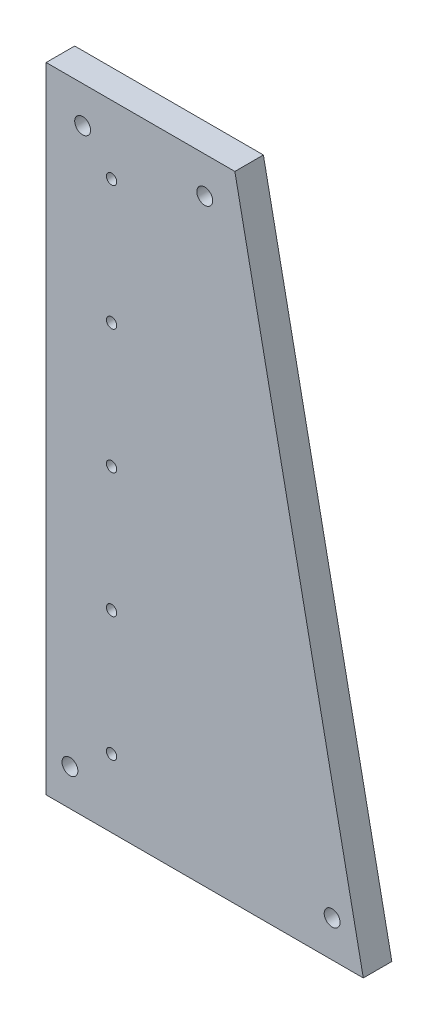
ISO-10303-21;
HEADER;
FILE_DESCRIPTION(('STEP AP214'),'2;1');
FILE_NAME('part.step','',(''),(''),'','','');
FILE_SCHEMA(('AUTOMOTIVE_DESIGN { 1 0 10303 214 1 1 1 1 }'));
ENDSEC;
DATA;
#1=APPLICATION_CONTEXT('core data for automotive mechanical design processes');
#2=APPLICATION_PROTOCOL_DEFINITION('international standard','automotive_design',2000,#1);
#3=PRODUCT_CONTEXT('',#1,'mechanical');
#4=PRODUCT('Part','Part','',(#3));
#5=PRODUCT_RELATED_PRODUCT_CATEGORY('part','',(#4));
#6=PRODUCT_DEFINITION_FORMATION('','',#4);
#7=PRODUCT_DEFINITION_CONTEXT('part definition',#1,'design');
#8=PRODUCT_DEFINITION('design','',#6,#7);
#9=PRODUCT_DEFINITION_SHAPE('','',#8);
#10=(LENGTH_UNIT() NAMED_UNIT(*) SI_UNIT(.MILLI.,.METRE.));
#11=(NAMED_UNIT(*) PLANE_ANGLE_UNIT() SI_UNIT($,.RADIAN.));
#12=(NAMED_UNIT(*) SI_UNIT($,.STERADIAN.) SOLID_ANGLE_UNIT());
#13=UNCERTAINTY_MEASURE_WITH_UNIT(LENGTH_MEASURE(1.E-05),#10,'distance_accuracy_value','');
#14=(GEOMETRIC_REPRESENTATION_CONTEXT(3) GLOBAL_UNCERTAINTY_ASSIGNED_CONTEXT((#13)) GLOBAL_UNIT_ASSIGNED_CONTEXT((#10,
#11,#12)) REPRESENTATION_CONTEXT('',''));
#15=CARTESIAN_POINT('',(0.,0.,0.));
#16=DIRECTION('',(0.,0.,1.));
#17=DIRECTION('',(1.,0.,0.));
#18=AXIS2_PLACEMENT_3D('',#15,#16,#17);
#19=CARTESIAN_POINT('',(-184.310735066979,157.079646017699,18.));
#20=DIRECTION('',(1.,0.,0.));
#21=DIRECTION('',(0.,0.,-1.));
#22=AXIS2_PLACEMENT_3D('',#19,#20,#21);
#23=PLANE('',#22);
#24=DIRECTION('',(0.,-1.,0.));
#25=VECTOR('',#24,1.);
#26=CARTESIAN_POINT('',(-184.310735066979,157.079646017699,0.));
#27=LINE('',#26,#25);
#28=CARTESIAN_POINT('',(-184.310735066979,157.079646017699,0.));
#29=VERTEX_POINT('',#28);
#30=CARTESIAN_POINT('',(-184.310735066979,-242.920353982301,0.));
#31=VERTEX_POINT('',#30);
#32=EDGE_CURVE('E97',#29,#31,#27,.T.);
#33=ORIENTED_EDGE('',*,*,#32,.T.);
#34=DIRECTION('',(0.,0.,-1.));
#35=VECTOR('',#34,1.);
#36=CARTESIAN_POINT('',(-184.310735066979,-242.920353982301,18.));
#37=LINE('',#36,#35);
#38=CARTESIAN_POINT('',(-184.310735066979,-242.920353982301,18.));
#39=VERTEX_POINT('',#38);
#40=EDGE_CURVE('E11',#39,#31,#37,.T.);
#41=ORIENTED_EDGE('',*,*,#40,.F.);
#42=DIRECTION('',(0.,-1.,0.));
#43=VECTOR('',#42,1.);
#44=CARTESIAN_POINT('',(-184.310735066979,157.079646017699,18.));
#45=LINE('',#44,#43);
#46=CARTESIAN_POINT('',(-184.310735066979,157.079646017699,18.));
#47=VERTEX_POINT('',#46);
#48=EDGE_CURVE('E85',#47,#39,#45,.T.);
#49=ORIENTED_EDGE('',*,*,#48,.F.);
#50=DIRECTION('',(0.,0.,-1.));
#51=VECTOR('',#50,1.);
#52=CARTESIAN_POINT('',(-184.310735066979,157.079646017699,18.));
#53=LINE('',#52,#51);
#54=EDGE_CURVE('E93',#47,#29,#53,.T.);
#55=ORIENTED_EDGE('',*,*,#54,.T.);
#56=EDGE_LOOP('',(#33,#41,#49,#55));
#57=FACE_BOUND('',#56,.T.);
#58=ADVANCED_FACE('F34',(#57),#23,.F.);
#59=CARTESIAN_POINT('',(15.6892649330213,-242.920353982301,18.));
#60=DIRECTION('',(0.,1.,0.));
#61=DIRECTION('',(-1.,0.,0.));
#62=AXIS2_PLACEMENT_3D('',#59,#60,#61);
#63=PLANE('',#62);
#64=DIRECTION('',(1.,0.,0.));
#65=VECTOR('',#64,1.);
#66=CARTESIAN_POINT('',(15.6892649330213,-242.920353982301,0.));
#67=LINE('',#66,#65);
#68=CARTESIAN_POINT('',(15.6892649330213,-242.920353982301,0.));
#69=VERTEX_POINT('',#68);
#70=EDGE_CURVE('E89',#31,#69,#67,.T.);
#71=ORIENTED_EDGE('',*,*,#70,.T.);
#72=DIRECTION('',(0.,0.,-1.));
#73=VECTOR('',#72,1.);
#74=CARTESIAN_POINT('',(15.6892649330213,-242.920353982301,18.));
#75=LINE('',#74,#73);
#76=CARTESIAN_POINT('',(15.6892649330213,-242.920353982301,18.));
#77=VERTEX_POINT('',#76);
#78=EDGE_CURVE('E42',#77,#69,#75,.T.);
#79=ORIENTED_EDGE('',*,*,#78,.F.);
#80=DIRECTION('',(1.,0.,0.));
#81=VECTOR('',#80,1.);
#82=CARTESIAN_POINT('',(-184.310735066979,-242.920353982301,18.));
#83=LINE('',#82,#81);
#84=EDGE_CURVE('E80',#39,#77,#83,.T.);
#85=ORIENTED_EDGE('',*,*,#84,.F.);
#86=ORIENTED_EDGE('',*,*,#40,.T.);
#87=EDGE_LOOP('',(#71,#79,#85,#86));
#88=FACE_BOUND('',#87,.T.);
#89=ADVANCED_FACE('F88',(#88),#63,.F.);
#90=CARTESIAN_POINT('',(-65.3107350669788,157.079646017699,18.));
#91=DIRECTION('',(-0.980106640178793,-0.198471594636206,0.));
#92=DIRECTION('',(0.198471594636206,-0.980106640178793,0.));
#93=AXIS2_PLACEMENT_3D('',#90,#91,#92);
#94=PLANE('',#93);
#95=DIRECTION('',(-0.198471594636206,0.980106640178793,0.));
#96=VECTOR('',#95,1.);
#97=CARTESIAN_POINT('',(-65.3107350669788,157.079646017699,0.));
#98=LINE('',#97,#96);
#99=CARTESIAN_POINT('',(-65.3107350669788,157.079646017699,0.));
#100=VERTEX_POINT('',#99);
#101=EDGE_CURVE('E67',#69,#100,#98,.T.);
#102=ORIENTED_EDGE('',*,*,#101,.T.);
#103=DIRECTION('',(0.,0.,-1.));
#104=VECTOR('',#103,1.);
#105=CARTESIAN_POINT('',(-65.3107350669788,157.079646017699,18.));
#106=LINE('',#105,#104);
#107=CARTESIAN_POINT('',(-65.3107350669788,157.079646017699,18.));
#108=VERTEX_POINT('',#107);
#109=EDGE_CURVE('E90',#108,#100,#106,.T.);
#110=ORIENTED_EDGE('',*,*,#109,.F.);
#111=DIRECTION('',(-0.198471594636206,0.980106640178793,0.));
#112=VECTOR('',#111,1.);
#113=CARTESIAN_POINT('',(-65.3107350669788,157.079646017699,18.));
#114=LINE('',#113,#112);
#115=EDGE_CURVE('E83',#77,#108,#114,.T.);
#116=ORIENTED_EDGE('',*,*,#115,.F.);
#117=ORIENTED_EDGE('',*,*,#78,.T.);
#118=EDGE_LOOP('',(#102,#110,#116,#117));
#119=FACE_BOUND('',#118,.T.);
#120=ADVANCED_FACE('F91',(#119),#94,.F.);
#121=CARTESIAN_POINT('',(-184.310735066979,157.079646017699,18.));
#122=DIRECTION('',(0.,-1.,0.));
#123=DIRECTION('',(0.,0.,-1.));
#124=AXIS2_PLACEMENT_3D('',#121,#122,#123);
#125=PLANE('',#124);
#126=DIRECTION('',(-1.,0.,0.));
#127=VECTOR('',#126,1.);
#128=CARTESIAN_POINT('',(-184.310735066979,157.079646017699,0.));
#129=LINE('',#128,#127);
#130=EDGE_CURVE('E73',#100,#29,#129,.T.);
#131=ORIENTED_EDGE('',*,*,#130,.T.);
#132=ORIENTED_EDGE('',*,*,#54,.F.);
#133=DIRECTION('',(-1.,0.,0.));
#134=VECTOR('',#133,1.);
#135=CARTESIAN_POINT('',(-184.310735066979,157.079646017699,18.));
#136=LINE('',#135,#134);
#137=EDGE_CURVE('E50',#108,#47,#136,.T.);
#138=ORIENTED_EDGE('',*,*,#137,.F.);
#139=ORIENTED_EDGE('',*,*,#109,.T.);
#140=EDGE_LOOP('',(#131,#132,#138,#139));
#141=FACE_BOUND('',#140,.T.);
#142=ADVANCED_FACE('F105',(#141),#125,.F.);
#143=CARTESIAN_POINT('',(0.,0.,18.));
#144=DIRECTION('',(0.,0.,1.));
#145=DIRECTION('',(1.,0.,0.));
#146=AXIS2_PLACEMENT_3D('',#143,#144,#145);
#147=PLANE('',#146);
#148=CARTESIAN_POINT('',(-161.310735066979,134.079646017699,18.));
#149=DIRECTION('',(0.,0.,-1.));
#150=DIRECTION('',(-1.,0.,0.));
#151=AXIS2_PLACEMENT_3D('',#148,#149,#150);
#152=CIRCLE('',#151,5.00000000000002);
#153=CARTESIAN_POINT('',(-166.310735066979,134.079646017699,18.));
#154=VERTEX_POINT('',#153);
#155=EDGE_CURVE('E114',#154,#154,#152,.T.);
#156=ORIENTED_EDGE('',*,*,#155,.T.);
#157=EDGE_LOOP('',(#156));
#158=FACE_BOUND('',#157,.T.);
#159=CARTESIAN_POINT('',(-143.060735066979,114.079646017699,18.));
#160=DIRECTION('',(0.,0.,-1.));
#161=DIRECTION('',(-1.,0.,0.));
#162=AXIS2_PLACEMENT_3D('',#159,#160,#161);
#163=CIRCLE('',#162,3.25000000000003);
#164=CARTESIAN_POINT('',(-146.310735066979,114.079646017699,18.));
#165=VERTEX_POINT('',#164);
#166=EDGE_CURVE('E156',#165,#165,#163,.T.);
#167=ORIENTED_EDGE('',*,*,#166,.T.);
#168=EDGE_LOOP('',(#167));
#169=FACE_BOUND('',#168,.T.);
#170=CARTESIAN_POINT('',(-143.06073506698,35.5796460176992,18.));
#171=DIRECTION('',(0.,0.,-1.));
#172=DIRECTION('',(-1.,0.,0.));
#173=AXIS2_PLACEMENT_3D('',#170,#171,#172);
#174=CIRCLE('',#173,3.25000000000003);
#175=CARTESIAN_POINT('',(-146.31073506698,35.5796460176992,18.));
#176=VERTEX_POINT('',#175);
#177=EDGE_CURVE('E150',#176,#176,#174,.T.);
#178=ORIENTED_EDGE('',*,*,#177,.T.);
#179=EDGE_LOOP('',(#178));
#180=FACE_BOUND('',#179,.T.);
#181=CARTESIAN_POINT('',(-143.06073506698,-42.9203539823008,18.));
#182=DIRECTION('',(0.,0.,-1.));
#183=DIRECTION('',(-1.,0.,0.));
#184=AXIS2_PLACEMENT_3D('',#181,#182,#183);
#185=CIRCLE('',#184,3.25000000000003);
#186=CARTESIAN_POINT('',(-146.31073506698,-42.9203539823008,18.));
#187=VERTEX_POINT('',#186);
#188=EDGE_CURVE('E144',#187,#187,#185,.T.);
#189=ORIENTED_EDGE('',*,*,#188,.T.);
#190=EDGE_LOOP('',(#189));
#191=FACE_BOUND('',#190,.T.);
#192=CARTESIAN_POINT('',(-143.060735066982,-199.920353982301,18.));
#193=DIRECTION('',(0.,0.,-1.));
#194=DIRECTION('',(-1.,0.,0.));
#195=AXIS2_PLACEMENT_3D('',#192,#193,#194);
#196=CIRCLE('',#195,3.25000000000003);
#197=CARTESIAN_POINT('',(-146.310735066982,-199.920353982301,18.));
#198=VERTEX_POINT('',#197);
#199=EDGE_CURVE('E134',#198,#198,#196,.T.);
#200=ORIENTED_EDGE('',*,*,#199,.T.);
#201=EDGE_LOOP('',(#200));
#202=FACE_BOUND('',#201,.T.);
#203=CARTESIAN_POINT('',(-3.96823506697869,-219.920353982301,18.));
#204=DIRECTION('',(0.,0.,-1.));
#205=DIRECTION('',(-1.,0.,0.));
#206=AXIS2_PLACEMENT_3D('',#203,#204,#205);
#207=CIRCLE('',#206,5.);
#208=CARTESIAN_POINT('',(-8.96823506697869,-219.920353982301,18.));
#209=VERTEX_POINT('',#208);
#210=EDGE_CURVE('E121',#209,#209,#207,.T.);
#211=ORIENTED_EDGE('',*,*,#210,.T.);
#212=EDGE_LOOP('',(#211));
#213=FACE_BOUND('',#212,.T.);
#214=CARTESIAN_POINT('',(-169.310735066979,-219.920353982301,18.));
#215=DIRECTION('',(0.,0.,-1.));
#216=DIRECTION('',(-1.,0.,0.));
#217=AXIS2_PLACEMENT_3D('',#214,#215,#216);
#218=CIRCLE('',#217,4.99999999999999);
#219=CARTESIAN_POINT('',(-174.310735066979,-219.920353982301,18.));
#220=VERTEX_POINT('',#219);
#221=EDGE_CURVE('E120',#220,#220,#218,.T.);
#222=ORIENTED_EDGE('',*,*,#221,.T.);
#223=EDGE_LOOP('',(#222));
#224=FACE_BOUND('',#223,.T.);
#225=CARTESIAN_POINT('',(-143.060735066981,-121.420353982301,18.));
#226=DIRECTION('',(0.,0.,-1.));
#227=DIRECTION('',(-1.,0.,0.));
#228=AXIS2_PLACEMENT_3D('',#225,#226,#227);
#229=CIRCLE('',#228,3.25000000000003);
#230=CARTESIAN_POINT('',(-146.310735066981,-121.420353982301,18.));
#231=VERTEX_POINT('',#230);
#232=EDGE_CURVE('E127',#231,#231,#229,.T.);
#233=ORIENTED_EDGE('',*,*,#232,.T.);
#234=EDGE_LOOP('',(#233));
#235=FACE_BOUND('',#234,.T.);
#236=CARTESIAN_POINT('',(-84.3107350669788,134.079646017699,18.));
#237=DIRECTION('',(0.,0.,-1.));
#238=DIRECTION('',(-1.,0.,0.));
#239=AXIS2_PLACEMENT_3D('',#236,#237,#238);
#240=CIRCLE('',#239,5.00000000000001);
#241=CARTESIAN_POINT('',(-89.3107350669788,134.079646017699,18.));
#242=VERTEX_POINT('',#241);
#243=EDGE_CURVE('E100',#242,#242,#240,.T.);
#244=ORIENTED_EDGE('',*,*,#243,.T.);
#245=EDGE_LOOP('',(#244));
#246=FACE_BOUND('',#245,.T.);
#247=ORIENTED_EDGE('',*,*,#48,.T.);
#248=ORIENTED_EDGE('',*,*,#84,.T.);
#249=ORIENTED_EDGE('',*,*,#115,.T.);
#250=ORIENTED_EDGE('',*,*,#137,.T.);
#251=EDGE_LOOP('',(#247,#248,#249,#250));
#252=FACE_BOUND('',#251,.T.);
#253=ADVANCED_FACE('F81',(#158,#169,#180,#191,#202,#213,#224,#235,#246,#252),#147,.T.);
#254=CARTESIAN_POINT('',(0.,0.,0.));
#255=DIRECTION('',(0.,0.,1.));
#256=DIRECTION('',(1.,0.,0.));
#257=AXIS2_PLACEMENT_3D('',#254,#255,#256);
#258=PLANE('',#257);
#259=CARTESIAN_POINT('',(-161.310735066979,134.079646017699,0.));
#260=DIRECTION('',(0.,0.,-1.));
#261=DIRECTION('',(-1.,0.,0.));
#262=AXIS2_PLACEMENT_3D('',#259,#260,#261);
#263=CIRCLE('',#262,5.00000000000002);
#264=CARTESIAN_POINT('',(-166.310735066979,134.079646017699,0.));
#265=VERTEX_POINT('',#264);
#266=EDGE_CURVE('E159',#265,#265,#263,.T.);
#267=ORIENTED_EDGE('',*,*,#266,.F.);
#268=EDGE_LOOP('',(#267));
#269=FACE_BOUND('',#268,.T.);
#270=CARTESIAN_POINT('',(-143.060735066979,114.079646017699,0.));
#271=DIRECTION('',(0.,0.,-1.));
#272=DIRECTION('',(-1.,0.,0.));
#273=AXIS2_PLACEMENT_3D('',#270,#271,#272);
#274=CIRCLE('',#273,3.25000000000003);
#275=CARTESIAN_POINT('',(-146.310735066979,114.079646017699,0.));
#276=VERTEX_POINT('',#275);
#277=EDGE_CURVE('E153',#276,#276,#274,.T.);
#278=ORIENTED_EDGE('',*,*,#277,.F.);
#279=EDGE_LOOP('',(#278));
#280=FACE_BOUND('',#279,.T.);
#281=CARTESIAN_POINT('',(-143.06073506698,35.5796460176992,0.));
#282=DIRECTION('',(0.,0.,-1.));
#283=DIRECTION('',(-1.,0.,0.));
#284=AXIS2_PLACEMENT_3D('',#281,#282,#283);
#285=CIRCLE('',#284,3.25000000000003);
#286=CARTESIAN_POINT('',(-146.31073506698,35.5796460176992,0.));
#287=VERTEX_POINT('',#286);
#288=EDGE_CURVE('E147',#287,#287,#285,.T.);
#289=ORIENTED_EDGE('',*,*,#288,.F.);
#290=EDGE_LOOP('',(#289));
#291=FACE_BOUND('',#290,.T.);
#292=CARTESIAN_POINT('',(-143.06073506698,-42.9203539823008,0.));
#293=DIRECTION('',(0.,0.,-1.));
#294=DIRECTION('',(-1.,0.,0.));
#295=AXIS2_PLACEMENT_3D('',#292,#293,#294);
#296=CIRCLE('',#295,3.25000000000003);
#297=CARTESIAN_POINT('',(-146.31073506698,-42.9203539823008,0.));
#298=VERTEX_POINT('',#297);
#299=EDGE_CURVE('E130',#298,#298,#296,.T.);
#300=ORIENTED_EDGE('',*,*,#299,.F.);
#301=EDGE_LOOP('',(#300));
#302=FACE_BOUND('',#301,.T.);
#303=CARTESIAN_POINT('',(-143.060735066982,-199.920353982301,0.));
#304=DIRECTION('',(0.,0.,-1.));
#305=DIRECTION('',(-1.,0.,0.));
#306=AXIS2_PLACEMENT_3D('',#303,#304,#305);
#307=CIRCLE('',#306,3.25000000000003);
#308=CARTESIAN_POINT('',(-146.310735066982,-199.920353982301,0.));
#309=VERTEX_POINT('',#308);
#310=EDGE_CURVE('E131',#309,#309,#307,.T.);
#311=ORIENTED_EDGE('',*,*,#310,.F.);
#312=EDGE_LOOP('',(#311));
#313=FACE_BOUND('',#312,.T.);
#314=CARTESIAN_POINT('',(-3.96823506697869,-219.920353982301,0.));
#315=DIRECTION('',(0.,0.,-1.));
#316=DIRECTION('',(-1.,0.,0.));
#317=AXIS2_PLACEMENT_3D('',#314,#315,#316);
#318=CIRCLE('',#317,5.);
#319=CARTESIAN_POINT('',(-8.96823506697869,-219.920353982301,0.));
#320=VERTEX_POINT('',#319);
#321=EDGE_CURVE('E137',#320,#320,#318,.T.);
#322=ORIENTED_EDGE('',*,*,#321,.F.);
#323=EDGE_LOOP('',(#322));
#324=FACE_BOUND('',#323,.T.);
#325=CARTESIAN_POINT('',(-169.310735066979,-219.920353982301,0.));
#326=DIRECTION('',(0.,0.,-1.));
#327=DIRECTION('',(-1.,0.,0.));
#328=AXIS2_PLACEMENT_3D('',#325,#326,#327);
#329=CIRCLE('',#328,4.99999999999999);
#330=CARTESIAN_POINT('',(-174.310735066979,-219.920353982301,0.));
#331=VERTEX_POINT('',#330);
#332=EDGE_CURVE('E117',#331,#331,#329,.T.);
#333=ORIENTED_EDGE('',*,*,#332,.F.);
#334=EDGE_LOOP('',(#333));
#335=FACE_BOUND('',#334,.T.);
#336=CARTESIAN_POINT('',(-143.060735066981,-121.420353982301,0.));
#337=DIRECTION('',(0.,0.,-1.));
#338=DIRECTION('',(-1.,0.,0.));
#339=AXIS2_PLACEMENT_3D('',#336,#337,#338);
#340=CIRCLE('',#339,3.25000000000003);
#341=CARTESIAN_POINT('',(-146.310735066981,-121.420353982301,0.));
#342=VERTEX_POINT('',#341);
#343=EDGE_CURVE('E124',#342,#342,#340,.T.);
#344=ORIENTED_EDGE('',*,*,#343,.F.);
#345=EDGE_LOOP('',(#344));
#346=FACE_BOUND('',#345,.T.);
#347=CARTESIAN_POINT('',(-84.3107350669788,134.079646017699,0.));
#348=DIRECTION('',(0.,0.,-1.));
#349=DIRECTION('',(-1.,0.,0.));
#350=AXIS2_PLACEMENT_3D('',#347,#348,#349);
#351=CIRCLE('',#350,5.00000000000001);
#352=CARTESIAN_POINT('',(-89.3107350669788,134.079646017699,0.));
#353=VERTEX_POINT('',#352);
#354=EDGE_CURVE('E111',#353,#353,#351,.T.);
#355=ORIENTED_EDGE('',*,*,#354,.F.);
#356=EDGE_LOOP('',(#355));
#357=FACE_BOUND('',#356,.T.);
#358=ORIENTED_EDGE('',*,*,#32,.F.);
#359=ORIENTED_EDGE('',*,*,#130,.F.);
#360=ORIENTED_EDGE('',*,*,#101,.F.);
#361=ORIENTED_EDGE('',*,*,#70,.F.);
#362=EDGE_LOOP('',(#358,#359,#360,#361));
#363=FACE_BOUND('',#362,.T.);
#364=ADVANCED_FACE('F108',(#269,#280,#291,#302,#313,#324,#335,#346,#357,#363),#258,.F.);
#365=CARTESIAN_POINT('',(-84.3107350669788,134.079646017699,18.));
#366=DIRECTION('',(0.,0.,-1.));
#367=DIRECTION('',(-1.,0.,0.));
#368=AXIS2_PLACEMENT_3D('',#365,#366,#367);
#369=CYLINDRICAL_SURFACE('',#368,5.00000000000001);
#370=ORIENTED_EDGE('',*,*,#243,.F.);
#371=EDGE_LOOP('',(#370));
#372=FACE_BOUND('',#371,.T.);
#373=ORIENTED_EDGE('',*,*,#354,.T.);
#374=EDGE_LOOP('',(#373));
#375=FACE_BOUND('',#374,.T.);
#376=ADVANCED_FACE('F176',(#372,#375),#369,.F.);
#377=CARTESIAN_POINT('',(-143.060735066981,-121.420353982301,18.));
#378=DIRECTION('',(0.,0.,-1.));
#379=DIRECTION('',(-1.,0.,0.));
#380=AXIS2_PLACEMENT_3D('',#377,#378,#379);
#381=CYLINDRICAL_SURFACE('',#380,3.25000000000003);
#382=ORIENTED_EDGE('',*,*,#232,.F.);
#383=EDGE_LOOP('',(#382));
#384=FACE_BOUND('',#383,.T.);
#385=ORIENTED_EDGE('',*,*,#343,.T.);
#386=EDGE_LOOP('',(#385));
#387=FACE_BOUND('',#386,.T.);
#388=ADVANCED_FACE('F195',(#384,#387),#381,.F.);
#389=CARTESIAN_POINT('',(-169.310735066979,-219.920353982301,18.));
#390=DIRECTION('',(0.,0.,-1.));
#391=DIRECTION('',(-1.,0.,0.));
#392=AXIS2_PLACEMENT_3D('',#389,#390,#391);
#393=CYLINDRICAL_SURFACE('',#392,4.99999999999999);
#394=ORIENTED_EDGE('',*,*,#221,.F.);
#395=EDGE_LOOP('',(#394));
#396=FACE_BOUND('',#395,.T.);
#397=ORIENTED_EDGE('',*,*,#332,.T.);
#398=EDGE_LOOP('',(#397));
#399=FACE_BOUND('',#398,.T.);
#400=ADVANCED_FACE('F201',(#396,#399),#393,.F.);
#401=CARTESIAN_POINT('',(-3.96823506697869,-219.920353982301,18.));
#402=DIRECTION('',(0.,0.,-1.));
#403=DIRECTION('',(-1.,0.,0.));
#404=AXIS2_PLACEMENT_3D('',#401,#402,#403);
#405=CYLINDRICAL_SURFACE('',#404,5.);
#406=ORIENTED_EDGE('',*,*,#210,.F.);
#407=EDGE_LOOP('',(#406));
#408=FACE_BOUND('',#407,.T.);
#409=ORIENTED_EDGE('',*,*,#321,.T.);
#410=EDGE_LOOP('',(#409));
#411=FACE_BOUND('',#410,.T.);
#412=ADVANCED_FACE('F245',(#408,#411),#405,.F.);
#413=CARTESIAN_POINT('',(-143.060735066982,-199.920353982301,18.));
#414=DIRECTION('',(0.,0.,-1.));
#415=DIRECTION('',(-1.,0.,0.));
#416=AXIS2_PLACEMENT_3D('',#413,#414,#415);
#417=CYLINDRICAL_SURFACE('',#416,3.25000000000003);
#418=ORIENTED_EDGE('',*,*,#199,.F.);
#419=EDGE_LOOP('',(#418));
#420=FACE_BOUND('',#419,.T.);
#421=ORIENTED_EDGE('',*,*,#310,.T.);
#422=EDGE_LOOP('',(#421));
#423=FACE_BOUND('',#422,.T.);
#424=ADVANCED_FACE('F254',(#420,#423),#417,.F.);
#425=CARTESIAN_POINT('',(-143.06073506698,-42.9203539823008,18.));
#426=DIRECTION('',(0.,0.,-1.));
#427=DIRECTION('',(-1.,0.,0.));
#428=AXIS2_PLACEMENT_3D('',#425,#426,#427);
#429=CYLINDRICAL_SURFACE('',#428,3.25000000000003);
#430=ORIENTED_EDGE('',*,*,#188,.F.);
#431=EDGE_LOOP('',(#430));
#432=FACE_BOUND('',#431,.T.);
#433=ORIENTED_EDGE('',*,*,#299,.T.);
#434=EDGE_LOOP('',(#433));
#435=FACE_BOUND('',#434,.T.);
#436=ADVANCED_FACE('F264',(#432,#435),#429,.F.);
#437=CARTESIAN_POINT('',(-143.06073506698,35.5796460176992,18.));
#438=DIRECTION('',(0.,0.,-1.));
#439=DIRECTION('',(-1.,0.,0.));
#440=AXIS2_PLACEMENT_3D('',#437,#438,#439);
#441=CYLINDRICAL_SURFACE('',#440,3.25000000000003);
#442=ORIENTED_EDGE('',*,*,#177,.F.);
#443=EDGE_LOOP('',(#442));
#444=FACE_BOUND('',#443,.T.);
#445=ORIENTED_EDGE('',*,*,#288,.T.);
#446=EDGE_LOOP('',(#445));
#447=FACE_BOUND('',#446,.T.);
#448=ADVANCED_FACE('F274',(#444,#447),#441,.F.);
#449=CARTESIAN_POINT('',(-143.060735066979,114.079646017699,18.));
#450=DIRECTION('',(0.,0.,-1.));
#451=DIRECTION('',(-1.,0.,0.));
#452=AXIS2_PLACEMENT_3D('',#449,#450,#451);
#453=CYLINDRICAL_SURFACE('',#452,3.25000000000003);
#454=ORIENTED_EDGE('',*,*,#166,.F.);
#455=EDGE_LOOP('',(#454));
#456=FACE_BOUND('',#455,.T.);
#457=ORIENTED_EDGE('',*,*,#277,.T.);
#458=EDGE_LOOP('',(#457));
#459=FACE_BOUND('',#458,.T.);
#460=ADVANCED_FACE('F170',(#456,#459),#453,.F.);
#461=CARTESIAN_POINT('',(-161.310735066979,134.079646017699,18.));
#462=DIRECTION('',(0.,0.,-1.));
#463=DIRECTION('',(-1.,0.,0.));
#464=AXIS2_PLACEMENT_3D('',#461,#462,#463);
#465=CYLINDRICAL_SURFACE('',#464,5.00000000000002);
#466=ORIENTED_EDGE('',*,*,#155,.F.);
#467=EDGE_LOOP('',(#466));
#468=FACE_BOUND('',#467,.T.);
#469=ORIENTED_EDGE('',*,*,#266,.T.);
#470=EDGE_LOOP('',(#469));
#471=FACE_BOUND('',#470,.T.);
#472=ADVANCED_FACE('F167',(#468,#471),#465,.F.);
#473=CLOSED_SHELL('',(#58,#89,#120,#142,#253,#364,#376,#388,#400,#412,#424,#436,#448,#460,#472));
#474=MANIFOLD_SOLID_BREP('B2',#473);
#475=ADVANCED_BREP_SHAPE_REPRESENTATION('',(#18,#474),#14);
#476=SHAPE_DEFINITION_REPRESENTATION(#9,#475);
ENDSEC;
END-ISO-10303-21;
